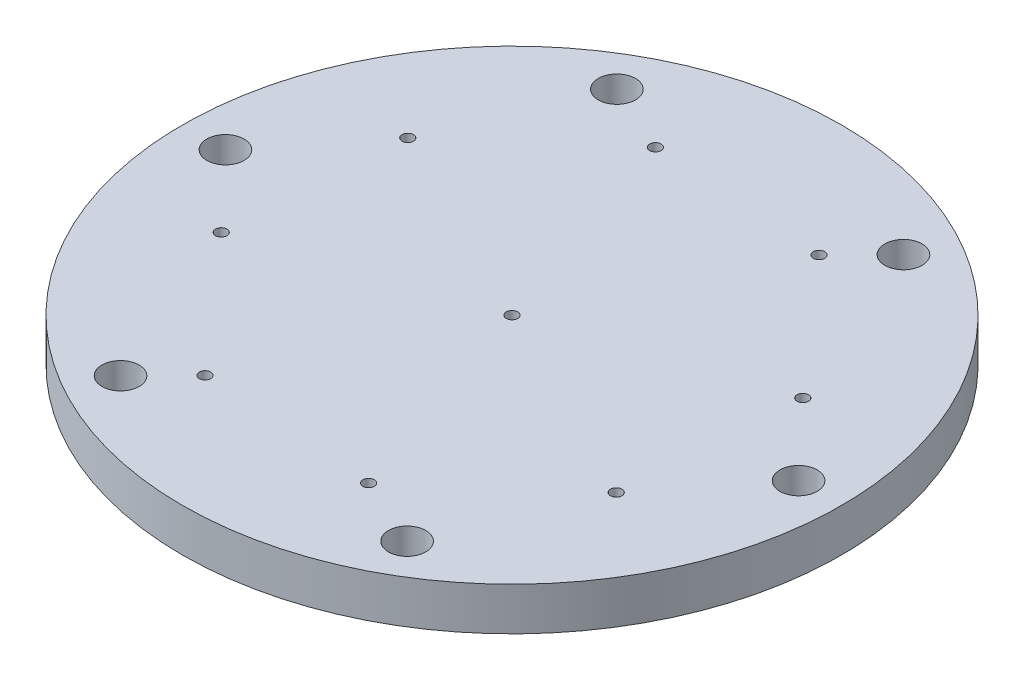
ISO-10303-21;
HEADER;
FILE_DESCRIPTION(('STEP AP214'),'2;1');
FILE_NAME('part.step','',(''),(''),'','','');
FILE_SCHEMA(('AUTOMOTIVE_DESIGN { 1 0 10303 214 1 1 1 1 }'));
ENDSEC;
DATA;
#1=APPLICATION_CONTEXT('core data for automotive mechanical design processes');
#2=APPLICATION_PROTOCOL_DEFINITION('international standard','automotive_design',2000,#1);
#3=PRODUCT_CONTEXT('',#1,'mechanical');
#4=PRODUCT('Part','Part','',(#3));
#5=PRODUCT_RELATED_PRODUCT_CATEGORY('part','',(#4));
#6=PRODUCT_DEFINITION_FORMATION('','',#4);
#7=PRODUCT_DEFINITION_CONTEXT('part definition',#1,'design');
#8=PRODUCT_DEFINITION('design','',#6,#7);
#9=PRODUCT_DEFINITION_SHAPE('','',#8);
#10=(LENGTH_UNIT() NAMED_UNIT(*) SI_UNIT(.MILLI.,.METRE.));
#11=(NAMED_UNIT(*) PLANE_ANGLE_UNIT() SI_UNIT($,.RADIAN.));
#12=(NAMED_UNIT(*) SI_UNIT($,.STERADIAN.) SOLID_ANGLE_UNIT());
#13=UNCERTAINTY_MEASURE_WITH_UNIT(LENGTH_MEASURE(1.E-05),#10,'distance_accuracy_value','');
#14=(GEOMETRIC_REPRESENTATION_CONTEXT(3) GLOBAL_UNCERTAINTY_ASSIGNED_CONTEXT((#13)) GLOBAL_UNIT_ASSIGNED_CONTEXT((#10,
#11,#12)) REPRESENTATION_CONTEXT('',''));
#15=CARTESIAN_POINT('',(0.,0.,0.));
#16=DIRECTION('',(0.,0.,1.));
#17=DIRECTION('',(1.,0.,0.));
#18=AXIS2_PLACEMENT_3D('',#15,#16,#17);
#19=CARTESIAN_POINT('',(0.,15.,0.));
#20=DIRECTION('',(0.,-1.,0.));
#21=DIRECTION('',(0.,0.,-1.));
#22=AXIS2_PLACEMENT_3D('',#19,#20,#21);
#23=CYLINDRICAL_SURFACE('',#22,65.);
#24=CARTESIAN_POINT('',(0.,0.,0.));
#25=DIRECTION('',(0.,1.,0.));
#26=DIRECTION('',(0.,0.,1.));
#27=AXIS2_PLACEMENT_3D('',#24,#25,#26);
#28=CIRCLE('',#27,65.);
#29=CARTESIAN_POINT('',(0.,0.,65.));
#30=VERTEX_POINT('',#29);
#31=EDGE_CURVE('E43',#30,#30,#28,.T.);
#32=ORIENTED_EDGE('',*,*,#31,.F.);
#33=EDGE_LOOP('',(#32));
#34=FACE_BOUND('',#33,.T.);
#35=CARTESIAN_POINT('',(0.,10.,0.));
#36=DIRECTION('',(0.,1.,0.));
#37=DIRECTION('',(0.,0.,1.));
#38=AXIS2_PLACEMENT_3D('',#35,#36,#37);
#39=CIRCLE('',#38,65.);
#40=CARTESIAN_POINT('',(0.,10.,65.));
#41=VERTEX_POINT('',#40);
#42=EDGE_CURVE('E129',#41,#41,#39,.T.);
#43=ORIENTED_EDGE('',*,*,#42,.T.);
#44=EDGE_LOOP('',(#43));
#45=FACE_BOUND('',#44,.T.);
#46=ADVANCED_FACE('F32',(#34,#45),#23,.F.);
#47=CARTESIAN_POINT('',(0.,15.,0.));
#48=DIRECTION('',(0.,1.,0.));
#49=DIRECTION('',(0.,0.,1.));
#50=AXIS2_PLACEMENT_3D('',#47,#48,#49);
#51=PLANE('',#50);
#52=CARTESIAN_POINT('',(0.,15.,0.));
#53=DIRECTION('',(0.,1.,0.));
#54=DIRECTION('',(0.,0.,1.));
#55=AXIS2_PLACEMENT_3D('',#52,#53,#54);
#56=CIRCLE('',#55,2.);
#57=CARTESIAN_POINT('',(0.,15.,2.));
#58=VERTEX_POINT('',#57);
#59=EDGE_CURVE('E134',#58,#58,#56,.F.);
#60=ORIENTED_EDGE('',*,*,#59,.T.);
#61=EDGE_LOOP('',(#60));
#62=FACE_BOUND('',#61,.T.);
#63=CARTESIAN_POINT('',(-75.7544103596066,15.,25.7151572242574));
#64=DIRECTION('',(0.,1.,0.));
#65=DIRECTION('',(0.,0.,1.));
#66=AXIS2_PLACEMENT_3D('',#63,#64,#65);
#67=CIRCLE('',#66,2.);
#68=CARTESIAN_POINT('',(-75.7544103596066,15.,27.7151572242574));
#69=VERTEX_POINT('',#68);
#70=EDGE_CURVE('E117',#69,#69,#67,.T.);
#71=ORIENTED_EDGE('',*,*,#70,.F.);
#72=EDGE_LOOP('',(#71));
#73=FACE_BOUND('',#72,.T.);
#74=CARTESIAN_POINT('',(25.7151572242592,15.,75.7544103596111));
#75=DIRECTION('',(0.,1.,0.));
#76=DIRECTION('',(0.,0.,1.));
#77=AXIS2_PLACEMENT_3D('',#74,#75,#76);
#78=CIRCLE('',#77,2.);
#79=CARTESIAN_POINT('',(25.7151572242592,15.,77.7544103596111));
#80=VERTEX_POINT('',#79);
#81=EDGE_CURVE('E105',#80,#80,#78,.T.);
#82=ORIENTED_EDGE('',*,*,#81,.F.);
#83=EDGE_LOOP('',(#82));
#84=FACE_BOUND('',#83,.T.);
#85=CARTESIAN_POINT('',(75.7544103596129,15.,-25.7151572242548));
#86=DIRECTION('',(0.,1.,0.));
#87=DIRECTION('',(0.,0.,1.));
#88=AXIS2_PLACEMENT_3D('',#85,#86,#87);
#89=CIRCLE('',#88,2.);
#90=CARTESIAN_POINT('',(75.7544103596129,15.,-23.7151572242548));
#91=VERTEX_POINT('',#90);
#92=EDGE_CURVE('E93',#91,#91,#89,.T.);
#93=ORIENTED_EDGE('',*,*,#92,.F.);
#94=EDGE_LOOP('',(#93));
#95=FACE_BOUND('',#94,.T.);
#96=CARTESIAN_POINT('',(-50.,15.,-86.6025403784439));
#97=DIRECTION('',(0.,1.,0.));
#98=DIRECTION('',(0.,0.,1.));
#99=AXIS2_PLACEMENT_3D('',#96,#97,#98);
#100=CIRCLE('',#99,6.5);
#101=CARTESIAN_POINT('',(-50.,15.,-80.1025403784439));
#102=VERTEX_POINT('',#101);
#103=EDGE_CURVE('E81',#102,#102,#100,.T.);
#104=ORIENTED_EDGE('',*,*,#103,.F.);
#105=EDGE_LOOP('',(#104));
#106=FACE_BOUND('',#105,.T.);
#107=CARTESIAN_POINT('',(-50.,15.,86.6025403784439));
#108=DIRECTION('',(0.,1.,0.));
#109=DIRECTION('',(0.,0.,1.));
#110=AXIS2_PLACEMENT_3D('',#107,#108,#109);
#111=CIRCLE('',#110,6.5);
#112=CARTESIAN_POINT('',(-50.,15.,93.1025403784439));
#113=VERTEX_POINT('',#112);
#114=EDGE_CURVE('E69',#113,#113,#111,.T.);
#115=ORIENTED_EDGE('',*,*,#114,.F.);
#116=EDGE_LOOP('',(#115));
#117=FACE_BOUND('',#116,.T.);
#118=CARTESIAN_POINT('',(100.,15.,0.));
#119=DIRECTION('',(0.,1.,0.));
#120=DIRECTION('',(0.,0.,1.));
#121=AXIS2_PLACEMENT_3D('',#118,#119,#120);
#122=CIRCLE('',#121,6.5);
#123=CARTESIAN_POINT('',(100.,15.,6.5));
#124=VERTEX_POINT('',#123);
#125=EDGE_CURVE('E57',#124,#124,#122,.T.);
#126=ORIENTED_EDGE('',*,*,#125,.F.);
#127=EDGE_LOOP('',(#126));
#128=FACE_BOUND('',#127,.T.);
#129=CARTESIAN_POINT('',(-25.7151572242529,15.,-75.7544103596085));
#130=DIRECTION('',(0.,1.,0.));
#131=DIRECTION('',(0.,0.,1.));
#132=AXIS2_PLACEMENT_3D('',#129,#130,#131);
#133=CIRCLE('',#132,2.00000000000001);
#134=CARTESIAN_POINT('',(-25.7151572242529,15.,-73.7544103596085));
#135=VERTEX_POINT('',#134);
#136=EDGE_CURVE('E47',#135,#135,#133,.T.);
#137=ORIENTED_EDGE('',*,*,#136,.F.);
#138=EDGE_LOOP('',(#137));
#139=FACE_BOUND('',#138,.T.);
#140=CARTESIAN_POINT('',(0.,15.,0.));
#141=DIRECTION('',(0.,1.,0.));
#142=DIRECTION('',(0.,0.,1.));
#143=AXIS2_PLACEMENT_3D('',#140,#141,#142);
#144=CIRCLE('',#143,115.);
#145=CARTESIAN_POINT('',(0.,15.,115.));
#146=VERTEX_POINT('',#145);
#147=EDGE_CURVE('E10',#146,#146,#144,.T.);
#148=ORIENTED_EDGE('',*,*,#147,.T.);
#149=EDGE_LOOP('',(#148));
#150=FACE_BOUND('',#149,.T.);
#151=CARTESIAN_POINT('',(50.,15.,-86.6025403784439));
#152=DIRECTION('',(0.,1.,0.));
#153=DIRECTION('',(0.,0.,1.));
#154=AXIS2_PLACEMENT_3D('',#151,#152,#153);
#155=CIRCLE('',#154,6.5);
#156=CARTESIAN_POINT('',(50.,15.,-80.1025403784439));
#157=VERTEX_POINT('',#156);
#158=EDGE_CURVE('E51',#157,#157,#155,.T.);
#159=ORIENTED_EDGE('',*,*,#158,.F.);
#160=EDGE_LOOP('',(#159));
#161=FACE_BOUND('',#160,.T.);
#162=CARTESIAN_POINT('',(50.,15.,86.6025403784439));
#163=DIRECTION('',(0.,1.,0.));
#164=DIRECTION('',(0.,0.,1.));
#165=AXIS2_PLACEMENT_3D('',#162,#163,#164);
#166=CIRCLE('',#165,6.5);
#167=CARTESIAN_POINT('',(50.,15.,93.1025403784439));
#168=VERTEX_POINT('',#167);
#169=EDGE_CURVE('E63',#168,#168,#166,.T.);
#170=ORIENTED_EDGE('',*,*,#169,.F.);
#171=EDGE_LOOP('',(#170));
#172=FACE_BOUND('',#171,.T.);
#173=CARTESIAN_POINT('',(-100.,15.,0.));
#174=DIRECTION('',(0.,1.,0.));
#175=DIRECTION('',(0.,0.,1.));
#176=AXIS2_PLACEMENT_3D('',#173,#174,#175);
#177=CIRCLE('',#176,6.5);
#178=CARTESIAN_POINT('',(-100.,15.,6.5));
#179=VERTEX_POINT('',#178);
#180=EDGE_CURVE('E75',#179,#179,#177,.T.);
#181=ORIENTED_EDGE('',*,*,#180,.F.);
#182=EDGE_LOOP('',(#181));
#183=FACE_BOUND('',#182,.T.);
#184=CARTESIAN_POINT('',(35.383095217522,15.,-71.7498193226169));
#185=DIRECTION('',(0.,1.,0.));
#186=DIRECTION('',(0.,0.,1.));
#187=AXIS2_PLACEMENT_3D('',#184,#185,#186);
#188=CIRCLE('',#187,2.);
#189=CARTESIAN_POINT('',(35.383095217522,15.,-69.7498193226169));
#190=VERTEX_POINT('',#189);
#191=EDGE_CURVE('E87',#190,#190,#188,.T.);
#192=ORIENTED_EDGE('',*,*,#191,.F.);
#193=EDGE_LOOP('',(#192));
#194=FACE_BOUND('',#193,.T.);
#195=CARTESIAN_POINT('',(71.7498193226214,15.,35.3830952175201));
#196=DIRECTION('',(0.,1.,0.));
#197=DIRECTION('',(0.,0.,1.));
#198=AXIS2_PLACEMENT_3D('',#195,#196,#197);
#199=CIRCLE('',#198,2.);
#200=CARTESIAN_POINT('',(71.7498193226214,15.,37.3830952175201));
#201=VERTEX_POINT('',#200);
#202=EDGE_CURVE('E99',#201,#201,#199,.T.);
#203=ORIENTED_EDGE('',*,*,#202,.F.);
#204=EDGE_LOOP('',(#203));
#205=FACE_BOUND('',#204,.T.);
#206=CARTESIAN_POINT('',(-35.3830952175156,15.,71.7498193226195));
#207=DIRECTION('',(0.,1.,0.));
#208=DIRECTION('',(0.,0.,1.));
#209=AXIS2_PLACEMENT_3D('',#206,#207,#208);
#210=CIRCLE('',#209,2.);
#211=CARTESIAN_POINT('',(-35.3830952175156,15.,73.7498193226195));
#212=VERTEX_POINT('',#211);
#213=EDGE_CURVE('E111',#212,#212,#210,.T.);
#214=ORIENTED_EDGE('',*,*,#213,.F.);
#215=EDGE_LOOP('',(#214));
#216=FACE_BOUND('',#215,.T.);
#217=CARTESIAN_POINT('',(-71.749819322615,15.,-35.3830952175175));
#218=DIRECTION('',(0.,1.,0.));
#219=DIRECTION('',(0.,0.,1.));
#220=AXIS2_PLACEMENT_3D('',#217,#218,#219);
#221=CIRCLE('',#220,2.);
#222=CARTESIAN_POINT('',(-71.749819322615,15.,-33.3830952175175));
#223=VERTEX_POINT('',#222);
#224=EDGE_CURVE('E123',#223,#223,#221,.T.);
#225=ORIENTED_EDGE('',*,*,#224,.F.);
#226=EDGE_LOOP('',(#225));
#227=FACE_BOUND('',#226,.T.);
#228=ADVANCED_FACE('F152',(#62,#73,#84,#95,#106,#117,#128,#139,#150,#161,#172,#183,#194,#205,
#216,#227),#51,.T.);
#229=CARTESIAN_POINT('',(0.,0.,0.));
#230=DIRECTION('',(0.,1.,0.));
#231=DIRECTION('',(0.,0.,1.));
#232=AXIS2_PLACEMENT_3D('',#229,#230,#231);
#233=PLANE('',#232);
#234=CARTESIAN_POINT('',(0.,0.,0.));
#235=DIRECTION('',(0.,1.,0.));
#236=DIRECTION('',(0.,0.,1.));
#237=AXIS2_PLACEMENT_3D('',#234,#235,#236);
#238=CIRCLE('',#237,115.);
#239=CARTESIAN_POINT('',(0.,0.,115.));
#240=VERTEX_POINT('',#239);
#241=EDGE_CURVE('E36',#240,#240,#238,.T.);
#242=ORIENTED_EDGE('',*,*,#241,.F.);
#243=EDGE_LOOP('',(#242));
#244=FACE_BOUND('',#243,.T.);
#245=ORIENTED_EDGE('',*,*,#31,.T.);
#246=EDGE_LOOP('',(#245));
#247=FACE_BOUND('',#246,.T.);
#248=CARTESIAN_POINT('',(-25.7151572242529,0.,-75.7544103596085));
#249=DIRECTION('',(0.,1.,0.));
#250=DIRECTION('',(0.,0.,1.));
#251=AXIS2_PLACEMENT_3D('',#248,#249,#250);
#252=CIRCLE('',#251,2.00000000000001);
#253=CARTESIAN_POINT('',(-25.7151572242529,0.,-73.7544103596085));
#254=VERTEX_POINT('',#253);
#255=EDGE_CURVE('E48',#254,#254,#252,.T.);
#256=ORIENTED_EDGE('',*,*,#255,.T.);
#257=EDGE_LOOP('',(#256));
#258=FACE_BOUND('',#257,.T.);
#259=CARTESIAN_POINT('',(50.,0.,-86.6025403784439));
#260=DIRECTION('',(0.,1.,0.));
#261=DIRECTION('',(0.,0.,1.));
#262=AXIS2_PLACEMENT_3D('',#259,#260,#261);
#263=CIRCLE('',#262,6.5);
#264=CARTESIAN_POINT('',(50.,0.,-80.1025403784439));
#265=VERTEX_POINT('',#264);
#266=EDGE_CURVE('E54',#265,#265,#263,.T.);
#267=ORIENTED_EDGE('',*,*,#266,.T.);
#268=EDGE_LOOP('',(#267));
#269=FACE_BOUND('',#268,.T.);
#270=CARTESIAN_POINT('',(100.,0.,0.));
#271=DIRECTION('',(0.,1.,0.));
#272=DIRECTION('',(0.,0.,1.));
#273=AXIS2_PLACEMENT_3D('',#270,#271,#272);
#274=CIRCLE('',#273,6.5);
#275=CARTESIAN_POINT('',(100.,0.,6.5));
#276=VERTEX_POINT('',#275);
#277=EDGE_CURVE('E60',#276,#276,#274,.T.);
#278=ORIENTED_EDGE('',*,*,#277,.T.);
#279=EDGE_LOOP('',(#278));
#280=FACE_BOUND('',#279,.T.);
#281=CARTESIAN_POINT('',(50.,0.,86.6025403784439));
#282=DIRECTION('',(0.,1.,0.));
#283=DIRECTION('',(0.,0.,1.));
#284=AXIS2_PLACEMENT_3D('',#281,#282,#283);
#285=CIRCLE('',#284,6.5);
#286=CARTESIAN_POINT('',(50.,0.,93.1025403784439));
#287=VERTEX_POINT('',#286);
#288=EDGE_CURVE('E66',#287,#287,#285,.T.);
#289=ORIENTED_EDGE('',*,*,#288,.T.);
#290=EDGE_LOOP('',(#289));
#291=FACE_BOUND('',#290,.T.);
#292=CARTESIAN_POINT('',(-50.,0.,86.6025403784439));
#293=DIRECTION('',(0.,1.,0.));
#294=DIRECTION('',(0.,0.,1.));
#295=AXIS2_PLACEMENT_3D('',#292,#293,#294);
#296=CIRCLE('',#295,6.5);
#297=CARTESIAN_POINT('',(-50.,0.,93.1025403784439));
#298=VERTEX_POINT('',#297);
#299=EDGE_CURVE('E72',#298,#298,#296,.T.);
#300=ORIENTED_EDGE('',*,*,#299,.T.);
#301=EDGE_LOOP('',(#300));
#302=FACE_BOUND('',#301,.T.);
#303=CARTESIAN_POINT('',(-100.,0.,0.));
#304=DIRECTION('',(0.,1.,0.));
#305=DIRECTION('',(0.,0.,1.));
#306=AXIS2_PLACEMENT_3D('',#303,#304,#305);
#307=CIRCLE('',#306,6.5);
#308=CARTESIAN_POINT('',(-100.,0.,6.5));
#309=VERTEX_POINT('',#308);
#310=EDGE_CURVE('E78',#309,#309,#307,.T.);
#311=ORIENTED_EDGE('',*,*,#310,.T.);
#312=EDGE_LOOP('',(#311));
#313=FACE_BOUND('',#312,.T.);
#314=CARTESIAN_POINT('',(-50.,0.,-86.6025403784439));
#315=DIRECTION('',(0.,1.,0.));
#316=DIRECTION('',(0.,0.,1.));
#317=AXIS2_PLACEMENT_3D('',#314,#315,#316);
#318=CIRCLE('',#317,6.5);
#319=CARTESIAN_POINT('',(-50.,0.,-80.1025403784439));
#320=VERTEX_POINT('',#319);
#321=EDGE_CURVE('E84',#320,#320,#318,.T.);
#322=ORIENTED_EDGE('',*,*,#321,.T.);
#323=EDGE_LOOP('',(#322));
#324=FACE_BOUND('',#323,.T.);
#325=CARTESIAN_POINT('',(35.383095217522,0.,-71.7498193226169));
#326=DIRECTION('',(0.,1.,0.));
#327=DIRECTION('',(0.,0.,1.));
#328=AXIS2_PLACEMENT_3D('',#325,#326,#327);
#329=CIRCLE('',#328,2.);
#330=CARTESIAN_POINT('',(35.383095217522,0.,-69.7498193226169));
#331=VERTEX_POINT('',#330);
#332=EDGE_CURVE('E90',#331,#331,#329,.T.);
#333=ORIENTED_EDGE('',*,*,#332,.T.);
#334=EDGE_LOOP('',(#333));
#335=FACE_BOUND('',#334,.T.);
#336=CARTESIAN_POINT('',(75.7544103596129,0.,-25.7151572242548));
#337=DIRECTION('',(0.,1.,0.));
#338=DIRECTION('',(0.,0.,1.));
#339=AXIS2_PLACEMENT_3D('',#336,#337,#338);
#340=CIRCLE('',#339,2.);
#341=CARTESIAN_POINT('',(75.7544103596129,0.,-23.7151572242548));
#342=VERTEX_POINT('',#341);
#343=EDGE_CURVE('E96',#342,#342,#340,.T.);
#344=ORIENTED_EDGE('',*,*,#343,.T.);
#345=EDGE_LOOP('',(#344));
#346=FACE_BOUND('',#345,.T.);
#347=CARTESIAN_POINT('',(71.7498193226214,0.,35.3830952175201));
#348=DIRECTION('',(0.,1.,0.));
#349=DIRECTION('',(0.,0.,1.));
#350=AXIS2_PLACEMENT_3D('',#347,#348,#349);
#351=CIRCLE('',#350,2.);
#352=CARTESIAN_POINT('',(71.7498193226214,0.,37.3830952175201));
#353=VERTEX_POINT('',#352);
#354=EDGE_CURVE('E102',#353,#353,#351,.T.);
#355=ORIENTED_EDGE('',*,*,#354,.T.);
#356=EDGE_LOOP('',(#355));
#357=FACE_BOUND('',#356,.T.);
#358=CARTESIAN_POINT('',(25.7151572242592,0.,75.7544103596111));
#359=DIRECTION('',(0.,1.,0.));
#360=DIRECTION('',(0.,0.,1.));
#361=AXIS2_PLACEMENT_3D('',#358,#359,#360);
#362=CIRCLE('',#361,2.);
#363=CARTESIAN_POINT('',(25.7151572242592,0.,77.7544103596111));
#364=VERTEX_POINT('',#363);
#365=EDGE_CURVE('E108',#364,#364,#362,.T.);
#366=ORIENTED_EDGE('',*,*,#365,.T.);
#367=EDGE_LOOP('',(#366));
#368=FACE_BOUND('',#367,.T.);
#369=CARTESIAN_POINT('',(-35.3830952175156,0.,71.7498193226195));
#370=DIRECTION('',(0.,1.,0.));
#371=DIRECTION('',(0.,0.,1.));
#372=AXIS2_PLACEMENT_3D('',#369,#370,#371);
#373=CIRCLE('',#372,2.);
#374=CARTESIAN_POINT('',(-35.3830952175156,0.,73.7498193226195));
#375=VERTEX_POINT('',#374);
#376=EDGE_CURVE('E114',#375,#375,#373,.T.);
#377=ORIENTED_EDGE('',*,*,#376,.T.);
#378=EDGE_LOOP('',(#377));
#379=FACE_BOUND('',#378,.T.);
#380=CARTESIAN_POINT('',(-75.7544103596066,0.,25.7151572242574));
#381=DIRECTION('',(0.,1.,0.));
#382=DIRECTION('',(0.,0.,1.));
#383=AXIS2_PLACEMENT_3D('',#380,#381,#382);
#384=CIRCLE('',#383,2.);
#385=CARTESIAN_POINT('',(-75.7544103596066,0.,27.7151572242574));
#386=VERTEX_POINT('',#385);
#387=EDGE_CURVE('E120',#386,#386,#384,.T.);
#388=ORIENTED_EDGE('',*,*,#387,.T.);
#389=EDGE_LOOP('',(#388));
#390=FACE_BOUND('',#389,.T.);
#391=CARTESIAN_POINT('',(-71.749819322615,0.,-35.3830952175175));
#392=DIRECTION('',(0.,1.,0.));
#393=DIRECTION('',(0.,0.,1.));
#394=AXIS2_PLACEMENT_3D('',#391,#392,#393);
#395=CIRCLE('',#394,2.);
#396=CARTESIAN_POINT('',(-71.749819322615,0.,-33.3830952175175));
#397=VERTEX_POINT('',#396);
#398=EDGE_CURVE('E126',#397,#397,#395,.T.);
#399=ORIENTED_EDGE('',*,*,#398,.T.);
#400=EDGE_LOOP('',(#399));
#401=FACE_BOUND('',#400,.T.);
#402=ADVANCED_FACE('F158',(#244,#247,#258,#269,#280,#291,#302,#313,#324,#335,#346,#357,#368,
#379,#390,#401),#233,.F.);
#403=CARTESIAN_POINT('',(0.,15.,0.));
#404=DIRECTION('',(0.,-1.,0.));
#405=DIRECTION('',(0.,0.,-1.));
#406=AXIS2_PLACEMENT_3D('',#403,#404,#405);
#407=CYLINDRICAL_SURFACE('',#406,115.);
#408=ORIENTED_EDGE('',*,*,#147,.F.);
#409=EDGE_LOOP('',(#408));
#410=FACE_BOUND('',#409,.T.);
#411=ORIENTED_EDGE('',*,*,#241,.T.);
#412=EDGE_LOOP('',(#411));
#413=FACE_BOUND('',#412,.T.);
#414=ADVANCED_FACE('F34',(#410,#413),#407,.T.);
#415=CARTESIAN_POINT('',(-25.7151572242529,15.,-75.7544103596085));
#416=DIRECTION('',(0.,-1.,0.));
#417=DIRECTION('',(0.,0.,-1.));
#418=AXIS2_PLACEMENT_3D('',#415,#416,#417);
#419=CYLINDRICAL_SURFACE('',#418,2.00000000000001);
#420=ORIENTED_EDGE('',*,*,#136,.T.);
#421=EDGE_LOOP('',(#420));
#422=FACE_BOUND('',#421,.T.);
#423=ORIENTED_EDGE('',*,*,#255,.F.);
#424=EDGE_LOOP('',(#423));
#425=FACE_BOUND('',#424,.T.);
#426=ADVANCED_FACE('F163',(#422,#425),#419,.F.);
#427=CARTESIAN_POINT('',(50.,15.,-86.6025403784439));
#428=DIRECTION('',(0.,-1.,0.));
#429=DIRECTION('',(0.,0.,-1.));
#430=AXIS2_PLACEMENT_3D('',#427,#428,#429);
#431=CYLINDRICAL_SURFACE('',#430,6.5);
#432=ORIENTED_EDGE('',*,*,#158,.T.);
#433=EDGE_LOOP('',(#432));
#434=FACE_BOUND('',#433,.T.);
#435=ORIENTED_EDGE('',*,*,#266,.F.);
#436=EDGE_LOOP('',(#435));
#437=FACE_BOUND('',#436,.T.);
#438=ADVANCED_FACE('F251',(#434,#437),#431,.F.);
#439=CARTESIAN_POINT('',(100.,15.,0.));
#440=DIRECTION('',(0.,-1.,0.));
#441=DIRECTION('',(0.,0.,-1.));
#442=AXIS2_PLACEMENT_3D('',#439,#440,#441);
#443=CYLINDRICAL_SURFACE('',#442,6.5);
#444=ORIENTED_EDGE('',*,*,#125,.T.);
#445=EDGE_LOOP('',(#444));
#446=FACE_BOUND('',#445,.T.);
#447=ORIENTED_EDGE('',*,*,#277,.F.);
#448=EDGE_LOOP('',(#447));
#449=FACE_BOUND('',#448,.T.);
#450=ADVANCED_FACE('F248',(#446,#449),#443,.F.);
#451=CARTESIAN_POINT('',(50.,15.,86.6025403784439));
#452=DIRECTION('',(0.,-1.,0.));
#453=DIRECTION('',(0.,0.,-1.));
#454=AXIS2_PLACEMENT_3D('',#451,#452,#453);
#455=CYLINDRICAL_SURFACE('',#454,6.5);
#456=ORIENTED_EDGE('',*,*,#169,.T.);
#457=EDGE_LOOP('',(#456));
#458=FACE_BOUND('',#457,.T.);
#459=ORIENTED_EDGE('',*,*,#288,.F.);
#460=EDGE_LOOP('',(#459));
#461=FACE_BOUND('',#460,.T.);
#462=ADVANCED_FACE('F244',(#458,#461),#455,.F.);
#463=CARTESIAN_POINT('',(-50.,15.,86.6025403784439));
#464=DIRECTION('',(0.,-1.,0.));
#465=DIRECTION('',(0.,0.,-1.));
#466=AXIS2_PLACEMENT_3D('',#463,#464,#465);
#467=CYLINDRICAL_SURFACE('',#466,6.5);
#468=ORIENTED_EDGE('',*,*,#114,.T.);
#469=EDGE_LOOP('',(#468));
#470=FACE_BOUND('',#469,.T.);
#471=ORIENTED_EDGE('',*,*,#299,.F.);
#472=EDGE_LOOP('',(#471));
#473=FACE_BOUND('',#472,.T.);
#474=ADVANCED_FACE('F240',(#470,#473),#467,.F.);
#475=CARTESIAN_POINT('',(-100.,15.,0.));
#476=DIRECTION('',(0.,-1.,0.));
#477=DIRECTION('',(0.,0.,-1.));
#478=AXIS2_PLACEMENT_3D('',#475,#476,#477);
#479=CYLINDRICAL_SURFACE('',#478,6.5);
#480=ORIENTED_EDGE('',*,*,#180,.T.);
#481=EDGE_LOOP('',(#480));
#482=FACE_BOUND('',#481,.T.);
#483=ORIENTED_EDGE('',*,*,#310,.F.);
#484=EDGE_LOOP('',(#483));
#485=FACE_BOUND('',#484,.T.);
#486=ADVANCED_FACE('F236',(#482,#485),#479,.F.);
#487=CARTESIAN_POINT('',(-50.,15.,-86.6025403784439));
#488=DIRECTION('',(0.,-1.,0.));
#489=DIRECTION('',(0.,0.,-1.));
#490=AXIS2_PLACEMENT_3D('',#487,#488,#489);
#491=CYLINDRICAL_SURFACE('',#490,6.5);
#492=ORIENTED_EDGE('',*,*,#103,.T.);
#493=EDGE_LOOP('',(#492));
#494=FACE_BOUND('',#493,.T.);
#495=ORIENTED_EDGE('',*,*,#321,.F.);
#496=EDGE_LOOP('',(#495));
#497=FACE_BOUND('',#496,.T.);
#498=ADVANCED_FACE('F232',(#494,#497),#491,.F.);
#499=CARTESIAN_POINT('',(35.383095217522,15.,-71.7498193226169));
#500=DIRECTION('',(0.,-1.,0.));
#501=DIRECTION('',(0.,0.,-1.));
#502=AXIS2_PLACEMENT_3D('',#499,#500,#501);
#503=CYLINDRICAL_SURFACE('',#502,2.);
#504=ORIENTED_EDGE('',*,*,#191,.T.);
#505=EDGE_LOOP('',(#504));
#506=FACE_BOUND('',#505,.T.);
#507=ORIENTED_EDGE('',*,*,#332,.F.);
#508=EDGE_LOOP('',(#507));
#509=FACE_BOUND('',#508,.T.);
#510=ADVANCED_FACE('F228',(#506,#509),#503,.F.);
#511=CARTESIAN_POINT('',(75.7544103596129,15.,-25.7151572242548));
#512=DIRECTION('',(0.,-1.,0.));
#513=DIRECTION('',(0.,0.,-1.));
#514=AXIS2_PLACEMENT_3D('',#511,#512,#513);
#515=CYLINDRICAL_SURFACE('',#514,2.);
#516=ORIENTED_EDGE('',*,*,#92,.T.);
#517=EDGE_LOOP('',(#516));
#518=FACE_BOUND('',#517,.T.);
#519=ORIENTED_EDGE('',*,*,#343,.F.);
#520=EDGE_LOOP('',(#519));
#521=FACE_BOUND('',#520,.T.);
#522=ADVANCED_FACE('F224',(#518,#521),#515,.F.);
#523=CARTESIAN_POINT('',(71.7498193226214,15.,35.3830952175201));
#524=DIRECTION('',(0.,-1.,0.));
#525=DIRECTION('',(0.,0.,-1.));
#526=AXIS2_PLACEMENT_3D('',#523,#524,#525);
#527=CYLINDRICAL_SURFACE('',#526,2.);
#528=ORIENTED_EDGE('',*,*,#202,.T.);
#529=EDGE_LOOP('',(#528));
#530=FACE_BOUND('',#529,.T.);
#531=ORIENTED_EDGE('',*,*,#354,.F.);
#532=EDGE_LOOP('',(#531));
#533=FACE_BOUND('',#532,.T.);
#534=ADVANCED_FACE('F220',(#530,#533),#527,.F.);
#535=CARTESIAN_POINT('',(25.7151572242592,15.,75.7544103596111));
#536=DIRECTION('',(0.,-1.,0.));
#537=DIRECTION('',(0.,0.,-1.));
#538=AXIS2_PLACEMENT_3D('',#535,#536,#537);
#539=CYLINDRICAL_SURFACE('',#538,2.);
#540=ORIENTED_EDGE('',*,*,#81,.T.);
#541=EDGE_LOOP('',(#540));
#542=FACE_BOUND('',#541,.T.);
#543=ORIENTED_EDGE('',*,*,#365,.F.);
#544=EDGE_LOOP('',(#543));
#545=FACE_BOUND('',#544,.T.);
#546=ADVANCED_FACE('F216',(#542,#545),#539,.F.);
#547=CARTESIAN_POINT('',(-35.3830952175156,15.,71.7498193226195));
#548=DIRECTION('',(0.,-1.,0.));
#549=DIRECTION('',(0.,0.,-1.));
#550=AXIS2_PLACEMENT_3D('',#547,#548,#549);
#551=CYLINDRICAL_SURFACE('',#550,2.);
#552=ORIENTED_EDGE('',*,*,#213,.T.);
#553=EDGE_LOOP('',(#552));
#554=FACE_BOUND('',#553,.T.);
#555=ORIENTED_EDGE('',*,*,#376,.F.);
#556=EDGE_LOOP('',(#555));
#557=FACE_BOUND('',#556,.T.);
#558=ADVANCED_FACE('F209',(#554,#557),#551,.F.);
#559=CARTESIAN_POINT('',(-75.7544103596066,15.,25.7151572242574));
#560=DIRECTION('',(0.,-1.,0.));
#561=DIRECTION('',(0.,0.,-1.));
#562=AXIS2_PLACEMENT_3D('',#559,#560,#561);
#563=CYLINDRICAL_SURFACE('',#562,2.);
#564=ORIENTED_EDGE('',*,*,#70,.T.);
#565=EDGE_LOOP('',(#564));
#566=FACE_BOUND('',#565,.T.);
#567=ORIENTED_EDGE('',*,*,#387,.F.);
#568=EDGE_LOOP('',(#567));
#569=FACE_BOUND('',#568,.T.);
#570=ADVANCED_FACE('F203',(#566,#569),#563,.F.);
#571=CARTESIAN_POINT('',(-71.749819322615,15.,-35.3830952175175));
#572=DIRECTION('',(0.,-1.,0.));
#573=DIRECTION('',(0.,0.,-1.));
#574=AXIS2_PLACEMENT_3D('',#571,#572,#573);
#575=CYLINDRICAL_SURFACE('',#574,2.);
#576=ORIENTED_EDGE('',*,*,#224,.T.);
#577=EDGE_LOOP('',(#576));
#578=FACE_BOUND('',#577,.T.);
#579=ORIENTED_EDGE('',*,*,#398,.F.);
#580=EDGE_LOOP('',(#579));
#581=FACE_BOUND('',#580,.T.);
#582=ADVANCED_FACE('F147',(#578,#581),#575,.F.);
#583=CARTESIAN_POINT('',(0.,10.,0.));
#584=DIRECTION('',(0.,1.,0.));
#585=DIRECTION('',(0.,0.,1.));
#586=AXIS2_PLACEMENT_3D('',#583,#584,#585);
#587=PLANE('',#586);
#588=CARTESIAN_POINT('',(0.,10.,0.));
#589=DIRECTION('',(0.,-1.,0.));
#590=DIRECTION('',(0.,0.,-1.));
#591=AXIS2_PLACEMENT_3D('',#588,#589,#590);
#592=CIRCLE('',#591,2.);
#593=CARTESIAN_POINT('',(0.,10.,-2.));
#594=VERTEX_POINT('',#593);
#595=EDGE_CURVE('E137',#594,#594,#592,.T.);
#596=ORIENTED_EDGE('',*,*,#595,.F.);
#597=EDGE_LOOP('',(#596));
#598=FACE_BOUND('',#597,.T.);
#599=ORIENTED_EDGE('',*,*,#42,.F.);
#600=EDGE_LOOP('',(#599));
#601=FACE_BOUND('',#600,.T.);
#602=ADVANCED_FACE('F144',(#598,#601),#587,.F.);
#603=CARTESIAN_POINT('',(0.,20.6568542494924,0.));
#604=DIRECTION('',(0.,-1.,0.));
#605=DIRECTION('',(0.,0.,-1.));
#606=AXIS2_PLACEMENT_3D('',#603,#604,#605);
#607=CYLINDRICAL_SURFACE('',#606,2.);
#608=ORIENTED_EDGE('',*,*,#595,.T.);
#609=EDGE_LOOP('',(#608));
#610=FACE_BOUND('',#609,.T.);
#611=ORIENTED_EDGE('',*,*,#59,.F.);
#612=EDGE_LOOP('',(#611));
#613=FACE_BOUND('',#612,.T.);
#614=ADVANCED_FACE('F141',(#610,#613),#607,.F.);
#615=CLOSED_SHELL('',(#46,#228,#402,#414,#426,#438,#450,#462,#474,#486,#498,#510,#522,#534,#546,
#558,#570,#582,#602,#614));
#616=MANIFOLD_SOLID_BREP('B2',#615);
#617=ADVANCED_BREP_SHAPE_REPRESENTATION('',(#18,#616),#14);
#618=SHAPE_DEFINITION_REPRESENTATION(#9,#617);
ENDSEC;
END-ISO-10303-21;
